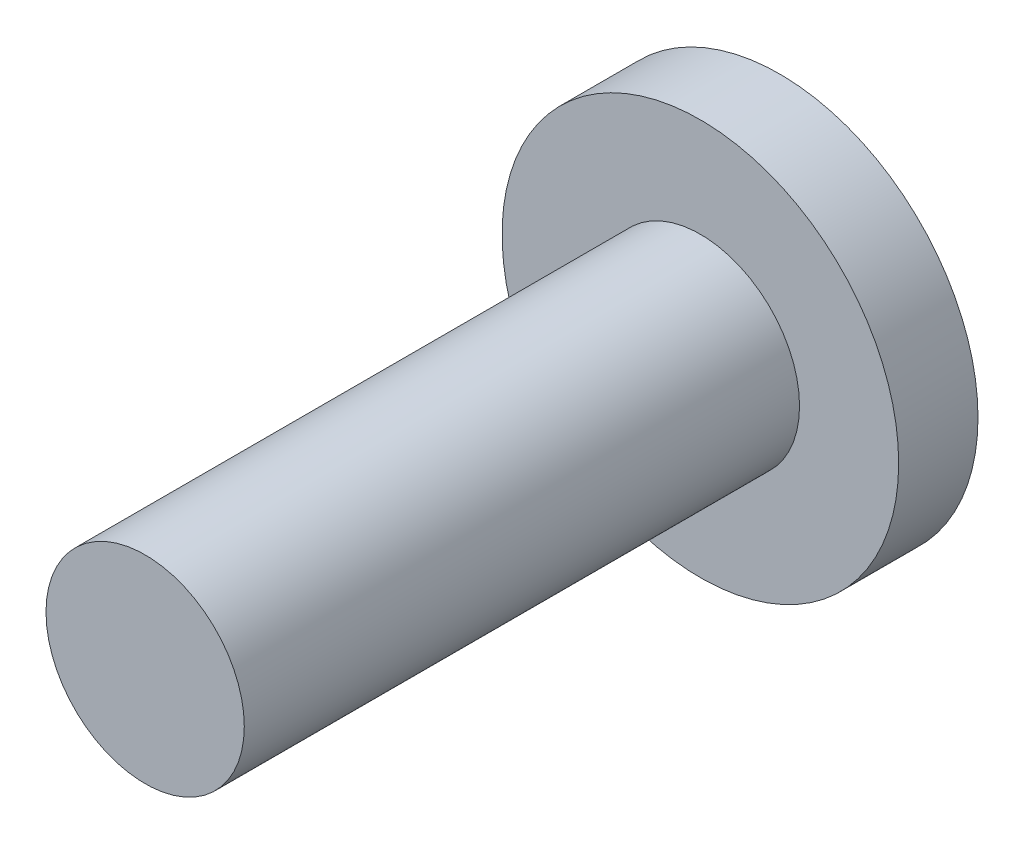
ISO-10303-21;
HEADER;
FILE_DESCRIPTION(('STEP AP214'),'2;1');
FILE_NAME('part.step','',(''),(''),'','','');
FILE_SCHEMA(('AUTOMOTIVE_DESIGN { 1 0 10303 214 1 1 1 1 }'));
ENDSEC;
DATA;
#1=APPLICATION_CONTEXT('core data for automotive mechanical design processes');
#2=APPLICATION_PROTOCOL_DEFINITION('international standard','automotive_design',2000,#1);
#3=PRODUCT_CONTEXT('',#1,'mechanical');
#4=PRODUCT('Part','Part','',(#3));
#5=PRODUCT_RELATED_PRODUCT_CATEGORY('part','',(#4));
#6=PRODUCT_DEFINITION_FORMATION('','',#4);
#7=PRODUCT_DEFINITION_CONTEXT('part definition',#1,'design');
#8=PRODUCT_DEFINITION('design','',#6,#7);
#9=PRODUCT_DEFINITION_SHAPE('','',#8);
#10=(LENGTH_UNIT() NAMED_UNIT(*) SI_UNIT(.MILLI.,.METRE.));
#11=(NAMED_UNIT(*) PLANE_ANGLE_UNIT() SI_UNIT($,.RADIAN.));
#12=(NAMED_UNIT(*) SI_UNIT($,.STERADIAN.) SOLID_ANGLE_UNIT());
#13=UNCERTAINTY_MEASURE_WITH_UNIT(LENGTH_MEASURE(1.E-05),#10,'distance_accuracy_value','');
#14=(GEOMETRIC_REPRESENTATION_CONTEXT(3) GLOBAL_UNCERTAINTY_ASSIGNED_CONTEXT((#13)) GLOBAL_UNIT_ASSIGNED_CONTEXT((#10,
#11,#12)) REPRESENTATION_CONTEXT('',''));
#15=CARTESIAN_POINT('',(0.,0.,0.));
#16=DIRECTION('',(0.,0.,1.));
#17=DIRECTION('',(1.,0.,0.));
#18=AXIS2_PLACEMENT_3D('',#15,#16,#17);
#19=CARTESIAN_POINT('',(0.,0.,7.));
#20=DIRECTION('',(0.,0.,-1.));
#21=DIRECTION('',(-1.,0.,0.));
#22=AXIS2_PLACEMENT_3D('',#19,#20,#21);
#23=CYLINDRICAL_SURFACE('',#22,1.25);
#24=CARTESIAN_POINT('',(0.,0.,7.));
#25=DIRECTION('',(0.,0.,1.));
#26=DIRECTION('',(1.,0.,0.));
#27=AXIS2_PLACEMENT_3D('',#24,#25,#26);
#28=CIRCLE('',#27,1.25);
#29=CARTESIAN_POINT('',(1.25,0.,7.));
#30=VERTEX_POINT('',#29);
#31=EDGE_CURVE('E10',#30,#30,#28,.T.);
#32=ORIENTED_EDGE('',*,*,#31,.F.);
#33=EDGE_LOOP('',(#32));
#34=FACE_BOUND('',#33,.T.);
#35=CARTESIAN_POINT('',(0.,0.,0.));
#36=DIRECTION('',(0.,0.,1.));
#37=DIRECTION('',(1.,0.,0.));
#38=AXIS2_PLACEMENT_3D('',#35,#36,#37);
#39=CIRCLE('',#38,1.25);
#40=CARTESIAN_POINT('',(1.25,0.,0.));
#41=VERTEX_POINT('',#40);
#42=EDGE_CURVE('E34',#41,#41,#39,.T.);
#43=ORIENTED_EDGE('',*,*,#42,.T.);
#44=EDGE_LOOP('',(#43));
#45=FACE_BOUND('',#44,.T.);
#46=ADVANCED_FACE('F31',(#34,#45),#23,.T.);
#47=CARTESIAN_POINT('',(0.,0.,7.));
#48=DIRECTION('',(0.,0.,1.));
#49=DIRECTION('',(1.,0.,0.));
#50=AXIS2_PLACEMENT_3D('',#47,#48,#49);
#51=PLANE('',#50);
#52=ORIENTED_EDGE('',*,*,#31,.T.);
#53=EDGE_LOOP('',(#52));
#54=FACE_BOUND('',#53,.T.);
#55=ADVANCED_FACE('F62',(#54),#51,.T.);
#56=CARTESIAN_POINT('',(0.,0.,-1.));
#57=DIRECTION('',(0.,0.,1.));
#58=DIRECTION('',(1.,0.,0.));
#59=AXIS2_PLACEMENT_3D('',#56,#57,#58);
#60=CYLINDRICAL_SURFACE('',#59,2.5);
#61=CARTESIAN_POINT('',(0.,0.,-1.));
#62=DIRECTION('',(0.,0.,1.));
#63=DIRECTION('',(1.,0.,0.));
#64=AXIS2_PLACEMENT_3D('',#61,#62,#63);
#65=CIRCLE('',#64,2.5);
#66=CARTESIAN_POINT('',(2.5,0.,-1.));
#67=VERTEX_POINT('',#66);
#68=EDGE_CURVE('E41',#67,#67,#65,.T.);
#69=ORIENTED_EDGE('',*,*,#68,.T.);
#70=EDGE_LOOP('',(#69));
#71=FACE_BOUND('',#70,.T.);
#72=CARTESIAN_POINT('',(0.,0.,0.));
#73=DIRECTION('',(0.,0.,1.));
#74=DIRECTION('',(1.,0.,0.));
#75=AXIS2_PLACEMENT_3D('',#72,#73,#74);
#76=CIRCLE('',#75,2.5);
#77=CARTESIAN_POINT('',(2.5,0.,0.));
#78=VERTEX_POINT('',#77);
#79=EDGE_CURVE('E43',#78,#78,#76,.T.);
#80=ORIENTED_EDGE('',*,*,#79,.F.);
#81=EDGE_LOOP('',(#80));
#82=FACE_BOUND('',#81,.T.);
#83=ADVANCED_FACE('F49',(#71,#82),#60,.T.);
#84=CARTESIAN_POINT('',(0.,0.,-1.));
#85=DIRECTION('',(0.,0.,1.));
#86=DIRECTION('',(1.,0.,0.));
#87=AXIS2_PLACEMENT_3D('',#84,#85,#86);
#88=PLANE('',#87);
#89=ORIENTED_EDGE('',*,*,#68,.F.);
#90=EDGE_LOOP('',(#89));
#91=FACE_BOUND('',#90,.T.);
#92=ADVANCED_FACE('F52',(#91),#88,.F.);
#93=CARTESIAN_POINT('',(0.,0.,0.));
#94=DIRECTION('',(0.,0.,1.));
#95=DIRECTION('',(1.,0.,0.));
#96=AXIS2_PLACEMENT_3D('',#93,#94,#95);
#97=PLANE('',#96);
#98=ORIENTED_EDGE('',*,*,#42,.F.);
#99=EDGE_LOOP('',(#98));
#100=FACE_BOUND('',#99,.T.);
#101=ORIENTED_EDGE('',*,*,#79,.T.);
#102=EDGE_LOOP('',(#101));
#103=FACE_BOUND('',#102,.T.);
#104=ADVANCED_FACE('F54',(#100,#103),#97,.T.);
#105=CLOSED_SHELL('',(#46,#55,#83,#92,#104));
#106=MANIFOLD_SOLID_BREP('B2',#105);
#107=ADVANCED_BREP_SHAPE_REPRESENTATION('',(#18,#106),#14);
#108=SHAPE_DEFINITION_REPRESENTATION(#9,#107);
ENDSEC;
END-ISO-10303-21;
